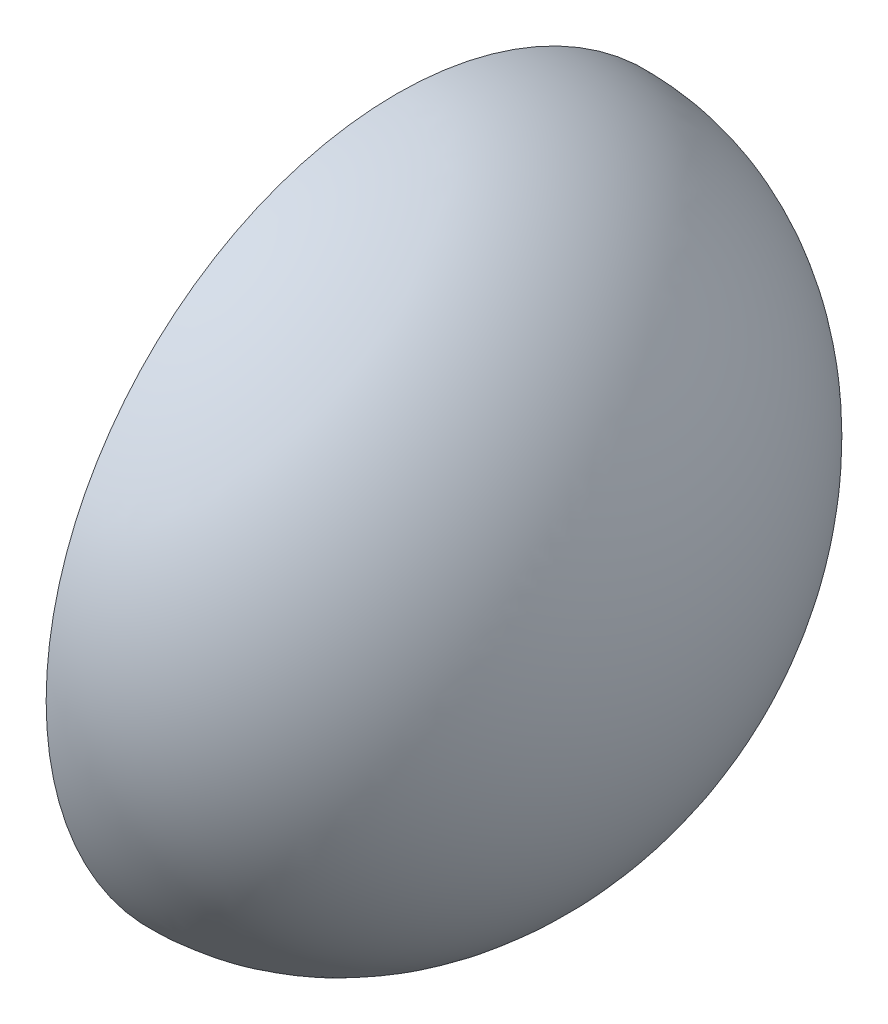
ISO-10303-21;
HEADER;
FILE_DESCRIPTION(('STEP AP214'),'2;1');
FILE_NAME('part.step','',(''),(''),'','','');
FILE_SCHEMA(('AUTOMOTIVE_DESIGN { 1 0 10303 214 1 1 1 1 }'));
ENDSEC;
DATA;
#1=APPLICATION_CONTEXT('core data for automotive mechanical design processes');
#2=APPLICATION_PROTOCOL_DEFINITION('international standard','automotive_design',2000,#1);
#3=PRODUCT_CONTEXT('',#1,'mechanical');
#4=PRODUCT('Part','Part','',(#3));
#5=PRODUCT_RELATED_PRODUCT_CATEGORY('part','',(#4));
#6=PRODUCT_DEFINITION_FORMATION('','',#4);
#7=PRODUCT_DEFINITION_CONTEXT('part definition',#1,'design');
#8=PRODUCT_DEFINITION('design','',#6,#7);
#9=PRODUCT_DEFINITION_SHAPE('','',#8);
#10=(LENGTH_UNIT() NAMED_UNIT(*) SI_UNIT(.MILLI.,.METRE.));
#11=(NAMED_UNIT(*) PLANE_ANGLE_UNIT() SI_UNIT($,.RADIAN.));
#12=(NAMED_UNIT(*) SI_UNIT($,.STERADIAN.) SOLID_ANGLE_UNIT());
#13=UNCERTAINTY_MEASURE_WITH_UNIT(LENGTH_MEASURE(1.E-05),#10,'distance_accuracy_value','');
#14=(GEOMETRIC_REPRESENTATION_CONTEXT(3) GLOBAL_UNCERTAINTY_ASSIGNED_CONTEXT((#13)) GLOBAL_UNIT_ASSIGNED_CONTEXT((#10,
#11,#12)) REPRESENTATION_CONTEXT('',''));
#15=CARTESIAN_POINT('',(0.,0.,0.));
#16=DIRECTION('',(0.,0.,1.));
#17=DIRECTION('',(1.,0.,0.));
#18=AXIS2_PLACEMENT_3D('',#15,#16,#17);
#19=CARTESIAN_POINT('',(10.7221,0.,0.));
#20=CARTESIAN_POINT('',(10.7221,-1.26661445312902,0.));
#21=CARTESIAN_POINT('',(10.319698011726,-3.87096579888505,0.));
#22=CARTESIAN_POINT('',(8.62924217461897,-7.08030847673216,0.));
#23=CARTESIAN_POINT('',(6.17391267852342,-9.15583001870256,0.));
#24=CARTESIAN_POINT('',(4.34879350307131,-9.6172,0.));
#25=CARTESIAN_POINT('',(3.4163,-9.6172,0.));
#26=B_SPLINE_CURVE_WITH_KNOTS('',3,(#19,#20,#21,#22,#23,#24,#25),.UNSPECIFIED.,.F.,.F.,(4,1,1,1,
4),(0.,0.392699081698724,0.785398163397448,1.17809724509617,1.5707963267949),.UNSPECIFIED.);
#27=CARTESIAN_POINT('',(-14.7193,0.,0.));
#28=DIRECTION('',(-1.,0.,0.));
#29=AXIS1_PLACEMENT('',#27,#28);
#30=SURFACE_OF_REVOLUTION('',#26,#29);
#31=CARTESIAN_POINT('',(3.4163,0.,0.));
#32=DIRECTION('',(-1.,0.,0.));
#33=DIRECTION('',(0.,0.,1.));
#34=AXIS2_PLACEMENT_3D('',#31,#32,#33);
#35=CIRCLE('',#34,9.6172);
#36=CARTESIAN_POINT('',(3.4163,0.,9.6172));
#37=VERTEX_POINT('',#36);
#38=EDGE_CURVE('E41',#37,#37,#35,.T.);
#39=ORIENTED_EDGE('',*,*,#38,.T.);
#40=EDGE_LOOP('',(#39));
#41=FACE_BOUND('',#40,.T.);
#42=CARTESIAN_POINT('',(10.7221,0.,0.));
#43=VERTEX_POINT('',#42);
#44=VERTEX_LOOP('',#43);
#45=FACE_BOUND('',#44,.T.);
#46=ADVANCED_FACE('F33',(#41,#45),#30,.F.);
#47=CARTESIAN_POINT('',(3.4163,0.,0.));
#48=DIRECTION('',(0.,0.,1.));
#49=DIRECTION('',(0.,-1.,0.));
#50=AXIS2_PLACEMENT_3D('',#47,#48,#49);
#51=ELLIPSE('',#50,10.6172,8.30579999999999);
#52=TRIMMED_CURVE('',#51,(PARAMETER_VALUE(-1.5707963267949)),(PARAMETER_VALUE(1.5707963267949)),
.T.,.PARAMETER.);
#53=CARTESIAN_POINT('',(-14.7193,0.,0.));
#54=DIRECTION('',(-1.,0.,0.));
#55=AXIS1_PLACEMENT('',#53,#54);
#56=SURFACE_OF_REVOLUTION('',#52,#55);
#57=CARTESIAN_POINT('',(11.7221,0.,0.));
#58=VERTEX_POINT('',#57);
#59=VERTEX_LOOP('',#58);
#60=FACE_BOUND('',#59,.T.);
#61=CARTESIAN_POINT('',(3.4163,0.,0.));
#62=DIRECTION('',(-1.,0.,0.));
#63=DIRECTION('',(0.,0.,1.));
#64=AXIS2_PLACEMENT_3D('',#61,#62,#63);
#65=CIRCLE('',#64,10.6172);
#66=CARTESIAN_POINT('',(3.4163,0.,10.6172));
#67=VERTEX_POINT('',#66);
#68=EDGE_CURVE('E11',#67,#67,#65,.T.);
#69=ORIENTED_EDGE('',*,*,#68,.F.);
#70=EDGE_LOOP('',(#69));
#71=FACE_BOUND('',#70,.T.);
#72=ADVANCED_FACE('F47',(#60,#71),#56,.F.);
#73=CARTESIAN_POINT('',(3.4163,-10.6172,0.));
#74=DIRECTION('',(-1.,0.,0.));
#75=DIRECTION('',(0.,0.,1.));
#76=AXIS2_PLACEMENT_3D('',#73,#74,#75);
#77=PLANE('',#76);
#78=ORIENTED_EDGE('',*,*,#68,.T.);
#79=EDGE_LOOP('',(#78));
#80=FACE_BOUND('',#79,.T.);
#81=ORIENTED_EDGE('',*,*,#38,.F.);
#82=EDGE_LOOP('',(#81));
#83=FACE_BOUND('',#82,.T.);
#84=ADVANCED_FACE('F50',(#80,#83),#77,.T.);
#85=CLOSED_SHELL('',(#46,#72,#84));
#86=MANIFOLD_SOLID_BREP('B2',#85);
#87=ADVANCED_BREP_SHAPE_REPRESENTATION('',(#18,#86),#14);
#88=SHAPE_DEFINITION_REPRESENTATION(#9,#87);
ENDSEC;
END-ISO-10303-21;
